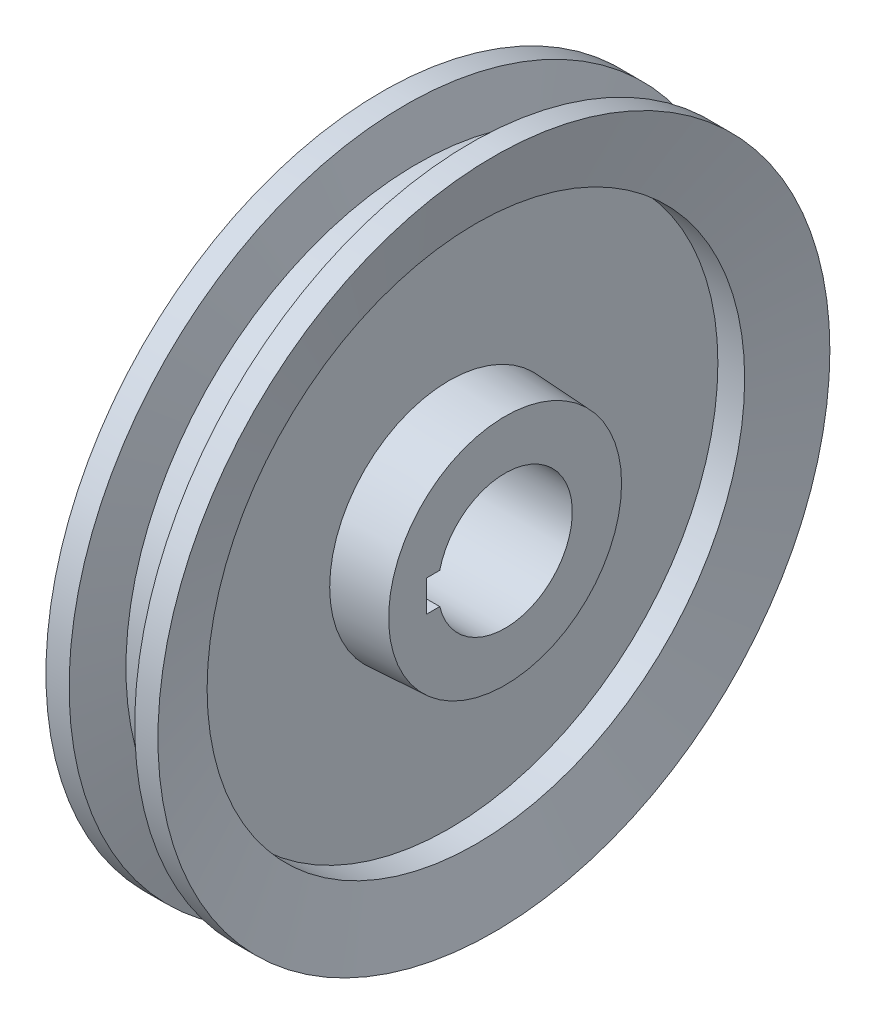
ISO-10303-21;
HEADER;
FILE_DESCRIPTION(('STEP AP214'),'2;1');
FILE_NAME('part.step','',(''),(''),'','','');
FILE_SCHEMA(('AUTOMOTIVE_DESIGN { 1 0 10303 214 1 1 1 1 }'));
ENDSEC;
DATA;
#1=APPLICATION_CONTEXT('core data for automotive mechanical design processes');
#2=APPLICATION_PROTOCOL_DEFINITION('international standard','automotive_design',2000,#1);
#3=PRODUCT_CONTEXT('',#1,'mechanical');
#4=PRODUCT('Part','Part','',(#3));
#5=PRODUCT_RELATED_PRODUCT_CATEGORY('part','',(#4));
#6=PRODUCT_DEFINITION_FORMATION('','',#4);
#7=PRODUCT_DEFINITION_CONTEXT('part definition',#1,'design');
#8=PRODUCT_DEFINITION('design','',#6,#7);
#9=PRODUCT_DEFINITION_SHAPE('','',#8);
#10=(LENGTH_UNIT() NAMED_UNIT(*) SI_UNIT(.MILLI.,.METRE.));
#11=(NAMED_UNIT(*) PLANE_ANGLE_UNIT() SI_UNIT($,.RADIAN.));
#12=(NAMED_UNIT(*) SI_UNIT($,.STERADIAN.) SOLID_ANGLE_UNIT());
#13=UNCERTAINTY_MEASURE_WITH_UNIT(LENGTH_MEASURE(1.E-05),#10,'distance_accuracy_value','');
#14=(GEOMETRIC_REPRESENTATION_CONTEXT(3) GLOBAL_UNCERTAINTY_ASSIGNED_CONTEXT((#13)) GLOBAL_UNIT_ASSIGNED_CONTEXT((#10,
#11,#12)) REPRESENTATION_CONTEXT('',''));
#15=CARTESIAN_POINT('',(0.,0.,0.));
#16=DIRECTION('',(0.,0.,1.));
#17=DIRECTION('',(1.,0.,0.));
#18=AXIS2_PLACEMENT_3D('',#15,#16,#17);
#19=CARTESIAN_POINT('',(-4.64412717363835,0.,0.));
#20=DIRECTION('',(-1.,0.,0.));
#21=DIRECTION('',(0.,0.,1.));
#22=AXIS2_PLACEMENT_3D('',#19,#20,#21);
#23=CONICAL_SURFACE('',#22,65.,1.30899693899575);
#24=CARTESIAN_POINT('',(-7.32361909794959,0.,0.));
#25=DIRECTION('',(1.,0.,0.));
#26=DIRECTION('',(0.,0.,-1.));
#27=AXIS2_PLACEMENT_3D('',#24,#25,#26);
#28=CIRCLE('',#27,75.);
#29=CARTESIAN_POINT('',(-7.32361909794959,0.,-75.));
#30=VERTEX_POINT('',#29);
#31=EDGE_CURVE('E105',#30,#30,#28,.T.);
#32=ORIENTED_EDGE('',*,*,#31,.T.);
#33=EDGE_LOOP('',(#32));
#34=FACE_BOUND('',#33,.T.);
#35=CARTESIAN_POINT('',(-4.64412717363835,0.,0.));
#36=DIRECTION('',(1.,0.,0.));
#37=DIRECTION('',(0.,0.,-1.));
#38=AXIS2_PLACEMENT_3D('',#35,#36,#37);
#39=CIRCLE('',#38,65.);
#40=CARTESIAN_POINT('',(-4.64412717363835,0.,-65.));
#41=VERTEX_POINT('',#40);
#42=EDGE_CURVE('E144',#41,#41,#39,.T.);
#43=ORIENTED_EDGE('',*,*,#42,.F.);
#44=EDGE_LOOP('',(#43));
#45=FACE_BOUND('',#44,.T.);
#46=ADVANCED_FACE('F33',(#34,#45),#23,.T.);
#47=CARTESIAN_POINT('',(15.,0.,0.));
#48=DIRECTION('',(1.,0.,0.));
#49=DIRECTION('',(0.,0.,-1.));
#50=AXIS2_PLACEMENT_3D('',#47,#48,#49);
#51=CYLINDRICAL_SURFACE('',#50,65.);
#52=ORIENTED_EDGE('',*,*,#42,.T.);
#53=EDGE_LOOP('',(#52));
#54=FACE_BOUND('',#53,.T.);
#55=CARTESIAN_POINT('',(4.64412717363835,0.,0.));
#56=DIRECTION('',(1.,0.,0.));
#57=DIRECTION('',(0.,0.,-1.));
#58=AXIS2_PLACEMENT_3D('',#55,#56,#57);
#59=CIRCLE('',#58,65.);
#60=CARTESIAN_POINT('',(4.64412717363835,0.,-65.));
#61=VERTEX_POINT('',#60);
#62=EDGE_CURVE('E141',#61,#61,#59,.T.);
#63=ORIENTED_EDGE('',*,*,#62,.F.);
#64=EDGE_LOOP('',(#63));
#65=FACE_BOUND('',#64,.T.);
#66=ADVANCED_FACE('F165',(#54,#65),#51,.T.);
#67=CARTESIAN_POINT('',(7.32361909794959,0.,0.));
#68=DIRECTION('',(1.,0.,0.));
#69=DIRECTION('',(0.,0.,-1.));
#70=AXIS2_PLACEMENT_3D('',#67,#68,#69);
#71=CONICAL_SURFACE('',#70,75.,1.30899693899575);
#72=ORIENTED_EDGE('',*,*,#62,.T.);
#73=EDGE_LOOP('',(#72));
#74=FACE_BOUND('',#73,.T.);
#75=CARTESIAN_POINT('',(7.32361909794959,0.,0.));
#76=DIRECTION('',(1.,0.,0.));
#77=DIRECTION('',(0.,0.,-1.));
#78=AXIS2_PLACEMENT_3D('',#75,#76,#77);
#79=CIRCLE('',#78,75.);
#80=CARTESIAN_POINT('',(7.32361909794959,0.,-75.));
#81=VERTEX_POINT('',#80);
#82=EDGE_CURVE('E138',#81,#81,#79,.T.);
#83=ORIENTED_EDGE('',*,*,#82,.F.);
#84=EDGE_LOOP('',(#83));
#85=FACE_BOUND('',#84,.T.);
#86=ADVANCED_FACE('F170',(#74,#85),#71,.T.);
#87=CARTESIAN_POINT('',(15.,0.,0.));
#88=DIRECTION('',(1.,0.,0.));
#89=DIRECTION('',(0.,0.,-1.));
#90=AXIS2_PLACEMENT_3D('',#87,#88,#89);
#91=CYLINDRICAL_SURFACE('',#90,75.);
#92=ORIENTED_EDGE('',*,*,#82,.T.);
#93=EDGE_LOOP('',(#92));
#94=FACE_BOUND('',#93,.T.);
#95=CARTESIAN_POINT('',(12.5,0.,0.));
#96=DIRECTION('',(1.,0.,0.));
#97=DIRECTION('',(0.,0.,-1.));
#98=AXIS2_PLACEMENT_3D('',#95,#96,#97);
#99=CIRCLE('',#98,75.);
#100=CARTESIAN_POINT('',(12.5,0.,-75.));
#101=VERTEX_POINT('',#100);
#102=EDGE_CURVE('E135',#101,#101,#99,.T.);
#103=ORIENTED_EDGE('',*,*,#102,.F.);
#104=EDGE_LOOP('',(#103));
#105=FACE_BOUND('',#104,.T.);
#106=ADVANCED_FACE('F180',(#94,#105),#91,.T.);
#107=CARTESIAN_POINT('',(8.48076211353315,0.,0.));
#108=DIRECTION('',(1.,0.,0.));
#109=DIRECTION('',(0.,0.,-1.));
#110=AXIS2_PLACEMENT_3D('',#107,#108,#109);
#111=CONICAL_SURFACE('',#110,60.,1.30899693899575);
#112=ORIENTED_EDGE('',*,*,#102,.T.);
#113=EDGE_LOOP('',(#112));
#114=FACE_BOUND('',#113,.T.);
#115=CARTESIAN_POINT('',(8.48076211353315,0.,0.));
#116=DIRECTION('',(1.,0.,0.));
#117=DIRECTION('',(0.,0.,-1.));
#118=AXIS2_PLACEMENT_3D('',#115,#116,#117);
#119=CIRCLE('',#118,60.);
#120=CARTESIAN_POINT('',(8.48076211353315,0.,-60.));
#121=VERTEX_POINT('',#120);
#122=EDGE_CURVE('E132',#121,#121,#119,.T.);
#123=ORIENTED_EDGE('',*,*,#122,.F.);
#124=EDGE_LOOP('',(#123));
#125=FACE_BOUND('',#124,.T.);
#126=ADVANCED_FACE('F186',(#114,#125),#111,.F.);
#127=CARTESIAN_POINT('',(15.,0.,0.));
#128=DIRECTION('',(1.,0.,0.));
#129=DIRECTION('',(0.,0.,-1.));
#130=AXIS2_PLACEMENT_3D('',#127,#128,#129);
#131=CYLINDRICAL_SURFACE('',#130,60.);
#132=ORIENTED_EDGE('',*,*,#122,.T.);
#133=EDGE_LOOP('',(#132));
#134=FACE_BOUND('',#133,.T.);
#135=CARTESIAN_POINT('',(2.5,0.,0.));
#136=DIRECTION('',(1.,0.,0.));
#137=DIRECTION('',(0.,0.,-1.));
#138=AXIS2_PLACEMENT_3D('',#135,#136,#137);
#139=CIRCLE('',#138,60.);
#140=CARTESIAN_POINT('',(2.5,0.,-60.));
#141=VERTEX_POINT('',#140);
#142=EDGE_CURVE('E129',#141,#141,#139,.T.);
#143=ORIENTED_EDGE('',*,*,#142,.F.);
#144=EDGE_LOOP('',(#143));
#145=FACE_BOUND('',#144,.T.);
#146=ADVANCED_FACE('F192',(#134,#145),#131,.F.);
#147=CARTESIAN_POINT('',(2.5,60.,0.));
#148=DIRECTION('',(1.,0.,0.));
#149=DIRECTION('',(0.,0.,-1.));
#150=AXIS2_PLACEMENT_3D('',#147,#148,#149);
#151=PLANE('',#150);
#152=ORIENTED_EDGE('',*,*,#142,.T.);
#153=EDGE_LOOP('',(#152));
#154=FACE_BOUND('',#153,.T.);
#155=CARTESIAN_POINT('',(2.5,0.,0.));
#156=DIRECTION('',(1.,0.,0.));
#157=DIRECTION('',(0.,0.,-1.));
#158=AXIS2_PLACEMENT_3D('',#155,#156,#157);
#159=CIRCLE('',#158,26.655097241038);
#160=CARTESIAN_POINT('',(2.5,0.,-26.655097241038));
#161=VERTEX_POINT('',#160);
#162=EDGE_CURVE('E126',#161,#161,#159,.T.);
#163=ORIENTED_EDGE('',*,*,#162,.F.);
#164=EDGE_LOOP('',(#163));
#165=FACE_BOUND('',#164,.T.);
#166=ADVANCED_FACE('F198',(#154,#165),#151,.T.);
#167=CARTESIAN_POINT('',(15.,0.,0.));
#168=DIRECTION('',(-1.,0.,0.));
#169=DIRECTION('',(0.,0.,1.));
#170=AXIS2_PLACEMENT_3D('',#167,#168,#169);
#171=CONICAL_SURFACE('',#170,26.,0.0523598775598305);
#172=ORIENTED_EDGE('',*,*,#162,.T.);
#173=EDGE_LOOP('',(#172));
#174=FACE_BOUND('',#173,.T.);
#175=CARTESIAN_POINT('',(15.,0.,0.));
#176=DIRECTION('',(1.,0.,0.));
#177=DIRECTION('',(0.,0.,-1.));
#178=AXIS2_PLACEMENT_3D('',#175,#176,#177);
#179=CIRCLE('',#178,26.);
#180=CARTESIAN_POINT('',(15.,0.,-26.));
#181=VERTEX_POINT('',#180);
#182=EDGE_CURVE('E123',#181,#181,#179,.T.);
#183=ORIENTED_EDGE('',*,*,#182,.F.);
#184=EDGE_LOOP('',(#183));
#185=FACE_BOUND('',#184,.T.);
#186=ADVANCED_FACE('F204',(#174,#185),#171,.T.);
#187=CARTESIAN_POINT('',(15.,26.,0.));
#188=DIRECTION('',(1.,0.,0.));
#189=DIRECTION('',(0.,0.,-1.));
#190=AXIS2_PLACEMENT_3D('',#187,#188,#189);
#191=PLANE('',#190);
#192=DIRECTION('',(0.,0.,-1.));
#193=VECTOR('',#192,1.);
#194=CARTESIAN_POINT('',(15.,-3.5,0.));
#195=LINE('',#194,#193);
#196=CARTESIAN_POINT('',(15.,-3.5,17.5));
#197=VERTEX_POINT('',#196);
#198=CARTESIAN_POINT('',(15.,-3.5,14.5859521458148));
#199=VERTEX_POINT('',#198);
#200=EDGE_CURVE('E92',#197,#199,#195,.T.);
#201=ORIENTED_EDGE('',*,*,#200,.F.);
#202=DIRECTION('',(0.,-1.,0.));
#203=VECTOR('',#202,1.);
#204=CARTESIAN_POINT('',(15.,-3.5,17.5));
#205=LINE('',#204,#203);
#206=CARTESIAN_POINT('',(15.,3.5,17.5));
#207=VERTEX_POINT('',#206);
#208=EDGE_CURVE('E79',#207,#197,#205,.T.);
#209=ORIENTED_EDGE('',*,*,#208,.F.);
#210=DIRECTION('',(0.,0.,1.));
#211=VECTOR('',#210,1.);
#212=CARTESIAN_POINT('',(15.,3.5,0.));
#213=LINE('',#212,#211);
#214=CARTESIAN_POINT('',(15.,3.5,14.5859521458148));
#215=VERTEX_POINT('',#214);
#216=EDGE_CURVE('E70',#215,#207,#213,.T.);
#217=ORIENTED_EDGE('',*,*,#216,.F.);
#218=CARTESIAN_POINT('',(15.,0.,0.));
#219=DIRECTION('',(1.,0.,0.));
#220=DIRECTION('',(0.,0.,-1.));
#221=AXIS2_PLACEMENT_3D('',#218,#219,#220);
#222=CIRCLE('',#221,15.);
#223=EDGE_CURVE('E99',#199,#215,#222,.T.);
#224=ORIENTED_EDGE('',*,*,#223,.F.);
#225=EDGE_LOOP('',(#201,#209,#217,#224));
#226=FACE_BOUND('',#225,.T.);
#227=ORIENTED_EDGE('',*,*,#182,.T.);
#228=EDGE_LOOP('',(#227));
#229=FACE_BOUND('',#228,.T.);
#230=ADVANCED_FACE('F90',(#226,#229),#191,.T.);
#231=CARTESIAN_POINT('',(-15.,26.,0.));
#232=DIRECTION('',(-1.,0.,0.));
#233=DIRECTION('',(0.,0.,1.));
#234=AXIS2_PLACEMENT_3D('',#231,#232,#233);
#235=PLANE('',#234);
#236=DIRECTION('',(0.,0.,-1.));
#237=VECTOR('',#236,1.);
#238=CARTESIAN_POINT('',(-15.,-3.5,0.));
#239=LINE('',#238,#237);
#240=CARTESIAN_POINT('',(-15.,-3.5,17.5));
#241=VERTEX_POINT('',#240);
#242=CARTESIAN_POINT('',(-15.,-3.5,14.5859521458148));
#243=VERTEX_POINT('',#242);
#244=EDGE_CURVE('E88',#241,#243,#239,.T.);
#245=ORIENTED_EDGE('',*,*,#244,.T.);
#246=CARTESIAN_POINT('',(-15.,0.,0.));
#247=DIRECTION('',(1.,0.,0.));
#248=DIRECTION('',(0.,0.,-1.));
#249=AXIS2_PLACEMENT_3D('',#246,#247,#248);
#250=CIRCLE('',#249,15.);
#251=CARTESIAN_POINT('',(-15.,3.5,14.5859521458148));
#252=VERTEX_POINT('',#251);
#253=EDGE_CURVE('E102',#243,#252,#250,.T.);
#254=ORIENTED_EDGE('',*,*,#253,.T.);
#255=DIRECTION('',(0.,0.,1.));
#256=VECTOR('',#255,1.);
#257=CARTESIAN_POINT('',(-15.,3.5,0.));
#258=LINE('',#257,#256);
#259=CARTESIAN_POINT('',(-15.,3.5,17.5));
#260=VERTEX_POINT('',#259);
#261=EDGE_CURVE('E47',#252,#260,#258,.T.);
#262=ORIENTED_EDGE('',*,*,#261,.T.);
#263=DIRECTION('',(0.,-1.,0.));
#264=VECTOR('',#263,1.);
#265=CARTESIAN_POINT('',(-15.,-3.5,17.5));
#266=LINE('',#265,#264);
#267=EDGE_CURVE('E86',#260,#241,#266,.T.);
#268=ORIENTED_EDGE('',*,*,#267,.T.);
#269=EDGE_LOOP('',(#245,#254,#262,#268));
#270=FACE_BOUND('',#269,.T.);
#271=CARTESIAN_POINT('',(-15.,0.,0.));
#272=DIRECTION('',(1.,0.,0.));
#273=DIRECTION('',(0.,0.,-1.));
#274=AXIS2_PLACEMENT_3D('',#271,#272,#273);
#275=CIRCLE('',#274,26.);
#276=CARTESIAN_POINT('',(-15.,0.,-26.));
#277=VERTEX_POINT('',#276);
#278=EDGE_CURVE('E120',#277,#277,#275,.T.);
#279=ORIENTED_EDGE('',*,*,#278,.F.);
#280=EDGE_LOOP('',(#279));
#281=FACE_BOUND('',#280,.T.);
#282=ADVANCED_FACE('F150',(#270,#281),#235,.T.);
#283=CARTESIAN_POINT('',(-2.5,0.,0.));
#284=DIRECTION('',(1.,0.,0.));
#285=DIRECTION('',(0.,0.,-1.));
#286=AXIS2_PLACEMENT_3D('',#283,#284,#285);
#287=CONICAL_SURFACE('',#286,26.655097241038,0.0523598775598305);
#288=ORIENTED_EDGE('',*,*,#278,.T.);
#289=EDGE_LOOP('',(#288));
#290=FACE_BOUND('',#289,.T.);
#291=CARTESIAN_POINT('',(-2.5,0.,0.));
#292=DIRECTION('',(1.,0.,0.));
#293=DIRECTION('',(0.,0.,-1.));
#294=AXIS2_PLACEMENT_3D('',#291,#292,#293);
#295=CIRCLE('',#294,26.655097241038);
#296=CARTESIAN_POINT('',(-2.5,0.,-26.655097241038));
#297=VERTEX_POINT('',#296);
#298=EDGE_CURVE('E117',#297,#297,#295,.T.);
#299=ORIENTED_EDGE('',*,*,#298,.F.);
#300=EDGE_LOOP('',(#299));
#301=FACE_BOUND('',#300,.T.);
#302=ADVANCED_FACE('F218',(#290,#301),#287,.T.);
#303=CARTESIAN_POINT('',(-2.5,60.,0.));
#304=DIRECTION('',(-1.,0.,0.));
#305=DIRECTION('',(0.,0.,1.));
#306=AXIS2_PLACEMENT_3D('',#303,#304,#305);
#307=PLANE('',#306);
#308=ORIENTED_EDGE('',*,*,#298,.T.);
#309=EDGE_LOOP('',(#308));
#310=FACE_BOUND('',#309,.T.);
#311=CARTESIAN_POINT('',(-2.5,0.,0.));
#312=DIRECTION('',(1.,0.,0.));
#313=DIRECTION('',(0.,0.,-1.));
#314=AXIS2_PLACEMENT_3D('',#311,#312,#313);
#315=CIRCLE('',#314,60.);
#316=CARTESIAN_POINT('',(-2.5,0.,-60.));
#317=VERTEX_POINT('',#316);
#318=EDGE_CURVE('E114',#317,#317,#315,.T.);
#319=ORIENTED_EDGE('',*,*,#318,.F.);
#320=EDGE_LOOP('',(#319));
#321=FACE_BOUND('',#320,.T.);
#322=ADVANCED_FACE('F223',(#310,#321),#307,.T.);
#323=CARTESIAN_POINT('',(15.,0.,0.));
#324=DIRECTION('',(1.,0.,0.));
#325=DIRECTION('',(0.,0.,-1.));
#326=AXIS2_PLACEMENT_3D('',#323,#324,#325);
#327=CYLINDRICAL_SURFACE('',#326,60.);
#328=ORIENTED_EDGE('',*,*,#318,.T.);
#329=EDGE_LOOP('',(#328));
#330=FACE_BOUND('',#329,.T.);
#331=CARTESIAN_POINT('',(-8.48076211353315,0.,0.));
#332=DIRECTION('',(1.,0.,0.));
#333=DIRECTION('',(0.,0.,-1.));
#334=AXIS2_PLACEMENT_3D('',#331,#332,#333);
#335=CIRCLE('',#334,60.);
#336=CARTESIAN_POINT('',(-8.48076211353315,0.,-60.));
#337=VERTEX_POINT('',#336);
#338=EDGE_CURVE('E111',#337,#337,#335,.T.);
#339=ORIENTED_EDGE('',*,*,#338,.F.);
#340=EDGE_LOOP('',(#339));
#341=FACE_BOUND('',#340,.T.);
#342=ADVANCED_FACE('F227',(#330,#341),#327,.F.);
#343=CARTESIAN_POINT('',(-12.5,0.,0.));
#344=DIRECTION('',(-1.,0.,0.));
#345=DIRECTION('',(0.,0.,1.));
#346=AXIS2_PLACEMENT_3D('',#343,#344,#345);
#347=CONICAL_SURFACE('',#346,75.,1.30899693899575);
#348=ORIENTED_EDGE('',*,*,#338,.T.);
#349=EDGE_LOOP('',(#348));
#350=FACE_BOUND('',#349,.T.);
#351=CARTESIAN_POINT('',(-12.5,0.,0.));
#352=DIRECTION('',(1.,0.,0.));
#353=DIRECTION('',(0.,0.,-1.));
#354=AXIS2_PLACEMENT_3D('',#351,#352,#353);
#355=CIRCLE('',#354,75.);
#356=CARTESIAN_POINT('',(-12.5,0.,-75.));
#357=VERTEX_POINT('',#356);
#358=EDGE_CURVE('E108',#357,#357,#355,.T.);
#359=ORIENTED_EDGE('',*,*,#358,.F.);
#360=EDGE_LOOP('',(#359));
#361=FACE_BOUND('',#360,.T.);
#362=ADVANCED_FACE('F231',(#350,#361),#347,.F.);
#363=CARTESIAN_POINT('',(15.,0.,0.));
#364=DIRECTION('',(1.,0.,0.));
#365=DIRECTION('',(0.,0.,-1.));
#366=AXIS2_PLACEMENT_3D('',#363,#364,#365);
#367=CYLINDRICAL_SURFACE('',#366,75.);
#368=ORIENTED_EDGE('',*,*,#358,.T.);
#369=EDGE_LOOP('',(#368));
#370=FACE_BOUND('',#369,.T.);
#371=ORIENTED_EDGE('',*,*,#31,.F.);
#372=EDGE_LOOP('',(#371));
#373=FACE_BOUND('',#372,.T.);
#374=ADVANCED_FACE('F161',(#370,#373),#367,.T.);
#375=CARTESIAN_POINT('',(-15.,0.,0.));
#376=DIRECTION('',(1.,0.,0.));
#377=DIRECTION('',(0.,0.,-1.));
#378=AXIS2_PLACEMENT_3D('',#375,#376,#377);
#379=CYLINDRICAL_SURFACE('',#378,15.);
#380=ORIENTED_EDGE('',*,*,#253,.F.);
#381=DIRECTION('',(1.,0.,0.));
#382=VECTOR('',#381,1.);
#383=CARTESIAN_POINT('',(-15.,-3.5,14.5859521458148));
#384=LINE('',#383,#382);
#385=EDGE_CURVE('E11',#243,#199,#384,.T.);
#386=ORIENTED_EDGE('',*,*,#385,.T.);
#387=ORIENTED_EDGE('',*,*,#223,.T.);
#388=DIRECTION('',(1.,0.,0.));
#389=VECTOR('',#388,1.);
#390=CARTESIAN_POINT('',(-15.,3.5,14.5859521458148));
#391=LINE('',#390,#389);
#392=EDGE_CURVE('E40',#215,#252,#391,.F.);
#393=ORIENTED_EDGE('',*,*,#392,.T.);
#394=EDGE_LOOP('',(#380,#386,#387,#393));
#395=FACE_BOUND('',#394,.T.);
#396=ADVANCED_FACE('F148',(#395),#379,.F.);
#397=CARTESIAN_POINT('',(-15.,-3.5,0.));
#398=DIRECTION('',(0.,-1.,0.));
#399=DIRECTION('',(0.,0.,-1.));
#400=AXIS2_PLACEMENT_3D('',#397,#398,#399);
#401=PLANE('',#400);
#402=ORIENTED_EDGE('',*,*,#244,.F.);
#403=DIRECTION('',(1.,0.,0.));
#404=VECTOR('',#403,1.);
#405=CARTESIAN_POINT('',(-15.,-3.5,17.5));
#406=LINE('',#405,#404);
#407=EDGE_CURVE('E87',#241,#197,#406,.T.);
#408=ORIENTED_EDGE('',*,*,#407,.T.);
#409=ORIENTED_EDGE('',*,*,#200,.T.);
#410=ORIENTED_EDGE('',*,*,#385,.F.);
#411=EDGE_LOOP('',(#402,#408,#409,#410));
#412=FACE_BOUND('',#411,.T.);
#413=ADVANCED_FACE('F152',(#412),#401,.F.);
#414=CARTESIAN_POINT('',(-15.,3.5,0.));
#415=DIRECTION('',(0.,1.,0.));
#416=DIRECTION('',(0.,0.,1.));
#417=AXIS2_PLACEMENT_3D('',#414,#415,#416);
#418=PLANE('',#417);
#419=ORIENTED_EDGE('',*,*,#216,.T.);
#420=DIRECTION('',(1.,0.,0.));
#421=VECTOR('',#420,1.);
#422=CARTESIAN_POINT('',(-15.,3.5,17.5));
#423=LINE('',#422,#421);
#424=EDGE_CURVE('E73',#260,#207,#423,.T.);
#425=ORIENTED_EDGE('',*,*,#424,.F.);
#426=ORIENTED_EDGE('',*,*,#261,.F.);
#427=ORIENTED_EDGE('',*,*,#392,.F.);
#428=EDGE_LOOP('',(#419,#425,#426,#427));
#429=FACE_BOUND('',#428,.T.);
#430=ADVANCED_FACE('F72',(#429),#418,.F.);
#431=CARTESIAN_POINT('',(-15.,-3.5,17.5));
#432=DIRECTION('',(0.,0.,1.));
#433=DIRECTION('',(1.,0.,0.));
#434=AXIS2_PLACEMENT_3D('',#431,#432,#433);
#435=PLANE('',#434);
#436=ORIENTED_EDGE('',*,*,#407,.F.);
#437=ORIENTED_EDGE('',*,*,#267,.F.);
#438=ORIENTED_EDGE('',*,*,#424,.T.);
#439=ORIENTED_EDGE('',*,*,#208,.T.);
#440=EDGE_LOOP('',(#436,#437,#438,#439));
#441=FACE_BOUND('',#440,.T.);
#442=ADVANCED_FACE('F83',(#441),#435,.F.);
#443=CLOSED_SHELL('',(#46,#66,#86,#106,#126,#146,#166,#186,#230,#282,#302,#322,#342,#362,#374,
#396,#413,#430,#442));
#444=MANIFOLD_SOLID_BREP('B2',#443);
#445=ADVANCED_BREP_SHAPE_REPRESENTATION('',(#18,#444),#14);
#446=SHAPE_DEFINITION_REPRESENTATION(#9,#445);
ENDSEC;
END-ISO-10303-21;
